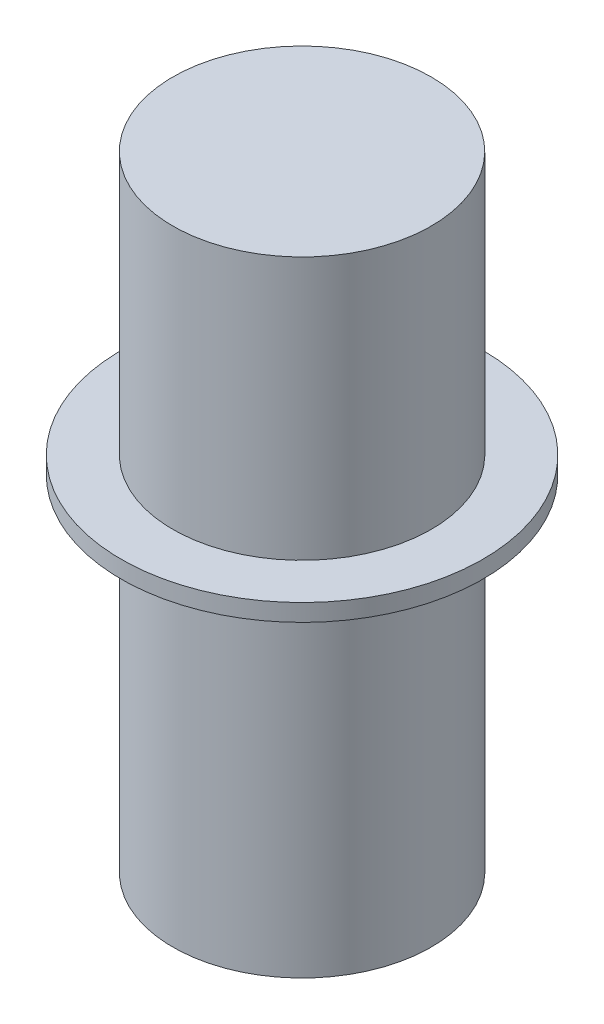
ISO-10303-21;
HEADER;
FILE_DESCRIPTION(('STEP AP214'),'2;1');
FILE_NAME('part.step','',(''),(''),'','','');
FILE_SCHEMA(('AUTOMOTIVE_DESIGN { 1 0 10303 214 1 1 1 1 }'));
ENDSEC;
DATA;
#1=APPLICATION_CONTEXT('core data for automotive mechanical design processes');
#2=APPLICATION_PROTOCOL_DEFINITION('international standard','automotive_design',2000,#1);
#3=PRODUCT_CONTEXT('',#1,'mechanical');
#4=PRODUCT('Part','Part','',(#3));
#5=PRODUCT_RELATED_PRODUCT_CATEGORY('part','',(#4));
#6=PRODUCT_DEFINITION_FORMATION('','',#4);
#7=PRODUCT_DEFINITION_CONTEXT('part definition',#1,'design');
#8=PRODUCT_DEFINITION('design','',#6,#7);
#9=PRODUCT_DEFINITION_SHAPE('','',#8);
#10=(LENGTH_UNIT() NAMED_UNIT(*) SI_UNIT(.MILLI.,.METRE.));
#11=(NAMED_UNIT(*) PLANE_ANGLE_UNIT() SI_UNIT($,.RADIAN.));
#12=(NAMED_UNIT(*) SI_UNIT($,.STERADIAN.) SOLID_ANGLE_UNIT());
#13=UNCERTAINTY_MEASURE_WITH_UNIT(LENGTH_MEASURE(1.E-05),#10,'distance_accuracy_value','');
#14=(GEOMETRIC_REPRESENTATION_CONTEXT(3) GLOBAL_UNCERTAINTY_ASSIGNED_CONTEXT((#13)) GLOBAL_UNIT_ASSIGNED_CONTEXT((#10,
#11,#12)) REPRESENTATION_CONTEXT('',''));
#15=CARTESIAN_POINT('',(0.,0.,0.));
#16=DIRECTION('',(0.,0.,1.));
#17=DIRECTION('',(1.,0.,0.));
#18=AXIS2_PLACEMENT_3D('',#15,#16,#17);
#19=CARTESIAN_POINT('',(0.,0.,0.));
#20=DIRECTION('',(0.,1.,0.));
#21=DIRECTION('',(0.,0.,1.));
#22=AXIS2_PLACEMENT_3D('',#19,#20,#21);
#23=PLANE('',#22);
#24=CARTESIAN_POINT('',(0.,0.,0.));
#25=DIRECTION('',(0.,-1.,0.));
#26=DIRECTION('',(0.,0.,-1.));
#27=AXIS2_PLACEMENT_3D('',#24,#25,#26);
#28=CIRCLE('',#27,15.);
#29=CARTESIAN_POINT('',(0.,0.,-15.));
#30=VERTEX_POINT('',#29);
#31=EDGE_CURVE('E10',#30,#30,#28,.T.);
#32=ORIENTED_EDGE('',*,*,#31,.T.);
#33=EDGE_LOOP('',(#32));
#34=FACE_BOUND('',#33,.T.);
#35=ADVANCED_FACE('F33',(#34),#23,.F.);
#36=CARTESIAN_POINT('',(0.,-22.4951294697904,0.));
#37=DIRECTION('',(0.,-1.,0.));
#38=DIRECTION('',(0.,0.,-1.));
#39=AXIS2_PLACEMENT_3D('',#36,#37,#38);
#40=CYLINDRICAL_SURFACE('',#39,15.);
#41=ORIENTED_EDGE('',*,*,#31,.F.);
#42=EDGE_LOOP('',(#41));
#43=FACE_BOUND('',#42,.T.);
#44=CARTESIAN_POINT('',(0.,40.,0.));
#45=DIRECTION('',(0.,-1.,0.));
#46=DIRECTION('',(0.,0.,-1.));
#47=AXIS2_PLACEMENT_3D('',#44,#45,#46);
#48=CIRCLE('',#47,15.);
#49=CARTESIAN_POINT('',(0.,40.,-15.));
#50=VERTEX_POINT('',#49);
#51=EDGE_CURVE('E39',#50,#50,#48,.T.);
#52=ORIENTED_EDGE('',*,*,#51,.T.);
#53=EDGE_LOOP('',(#52));
#54=FACE_BOUND('',#53,.T.);
#55=ADVANCED_FACE('F71',(#43,#54),#40,.T.);
#56=CARTESIAN_POINT('',(-15.,40.,0.));
#57=DIRECTION('',(0.,1.,0.));
#58=DIRECTION('',(0.,0.,1.));
#59=AXIS2_PLACEMENT_3D('',#56,#57,#58);
#60=PLANE('',#59);
#61=ORIENTED_EDGE('',*,*,#51,.F.);
#62=EDGE_LOOP('',(#61));
#63=FACE_BOUND('',#62,.T.);
#64=CARTESIAN_POINT('',(0.,40.,0.));
#65=DIRECTION('',(0.,-1.,0.));
#66=DIRECTION('',(0.,0.,-1.));
#67=AXIS2_PLACEMENT_3D('',#64,#65,#66);
#68=CIRCLE('',#67,21.);
#69=CARTESIAN_POINT('',(0.,40.,-21.));
#70=VERTEX_POINT('',#69);
#71=EDGE_CURVE('E43',#70,#70,#68,.T.);
#72=ORIENTED_EDGE('',*,*,#71,.T.);
#73=EDGE_LOOP('',(#72));
#74=FACE_BOUND('',#73,.T.);
#75=ADVANCED_FACE('F75',(#63,#74),#60,.F.);
#76=CARTESIAN_POINT('',(0.,-22.4951294697904,0.));
#77=DIRECTION('',(0.,-1.,0.));
#78=DIRECTION('',(0.,0.,-1.));
#79=AXIS2_PLACEMENT_3D('',#76,#77,#78);
#80=CYLINDRICAL_SURFACE('',#79,21.);
#81=ORIENTED_EDGE('',*,*,#71,.F.);
#82=EDGE_LOOP('',(#81));
#83=FACE_BOUND('',#82,.T.);
#84=CARTESIAN_POINT('',(0.,42.,0.));
#85=DIRECTION('',(0.,-1.,0.));
#86=DIRECTION('',(0.,0.,-1.));
#87=AXIS2_PLACEMENT_3D('',#84,#85,#86);
#88=CIRCLE('',#87,21.);
#89=CARTESIAN_POINT('',(0.,42.,-21.));
#90=VERTEX_POINT('',#89);
#91=EDGE_CURVE('E47',#90,#90,#88,.T.);
#92=ORIENTED_EDGE('',*,*,#91,.T.);
#93=EDGE_LOOP('',(#92));
#94=FACE_BOUND('',#93,.T.);
#95=ADVANCED_FACE('F80',(#83,#94),#80,.T.);
#96=CARTESIAN_POINT('',(-21.,42.,0.));
#97=DIRECTION('',(0.,-1.,0.));
#98=DIRECTION('',(0.,0.,-1.));
#99=AXIS2_PLACEMENT_3D('',#96,#97,#98);
#100=PLANE('',#99);
#101=ORIENTED_EDGE('',*,*,#91,.F.);
#102=EDGE_LOOP('',(#101));
#103=FACE_BOUND('',#102,.T.);
#104=CARTESIAN_POINT('',(0.,42.,0.));
#105=DIRECTION('',(0.,-1.,0.));
#106=DIRECTION('',(0.,0.,-1.));
#107=AXIS2_PLACEMENT_3D('',#104,#105,#106);
#108=CIRCLE('',#107,15.);
#109=CARTESIAN_POINT('',(0.,42.,-15.));
#110=VERTEX_POINT('',#109);
#111=EDGE_CURVE('E52',#110,#110,#108,.T.);
#112=ORIENTED_EDGE('',*,*,#111,.T.);
#113=EDGE_LOOP('',(#112));
#114=FACE_BOUND('',#113,.T.);
#115=ADVANCED_FACE('F67',(#103,#114),#100,.F.);
#116=CARTESIAN_POINT('',(0.,-22.4951294697904,0.));
#117=DIRECTION('',(0.,-1.,0.));
#118=DIRECTION('',(0.,0.,-1.));
#119=AXIS2_PLACEMENT_3D('',#116,#117,#118);
#120=CYLINDRICAL_SURFACE('',#119,15.);
#121=ORIENTED_EDGE('',*,*,#111,.F.);
#122=EDGE_LOOP('',(#121));
#123=FACE_BOUND('',#122,.T.);
#124=CARTESIAN_POINT('',(0.,72.5,0.));
#125=DIRECTION('',(0.,-1.,0.));
#126=DIRECTION('',(0.,0.,-1.));
#127=AXIS2_PLACEMENT_3D('',#124,#125,#126);
#128=CIRCLE('',#127,15.);
#129=CARTESIAN_POINT('',(0.,72.5,-15.));
#130=VERTEX_POINT('',#129);
#131=EDGE_CURVE('E55',#130,#130,#128,.T.);
#132=ORIENTED_EDGE('',*,*,#131,.T.);
#133=EDGE_LOOP('',(#132));
#134=FACE_BOUND('',#133,.T.);
#135=ADVANCED_FACE('F59',(#123,#134),#120,.T.);
#136=CARTESIAN_POINT('',(-15.,72.5,0.));
#137=DIRECTION('',(0.,-1.,0.));
#138=DIRECTION('',(0.,0.,-1.));
#139=AXIS2_PLACEMENT_3D('',#136,#137,#138);
#140=PLANE('',#139);
#141=ORIENTED_EDGE('',*,*,#131,.F.);
#142=EDGE_LOOP('',(#141));
#143=FACE_BOUND('',#142,.T.);
#144=ADVANCED_FACE('F61',(#143),#140,.F.);
#145=CLOSED_SHELL('',(#35,#55,#75,#95,#115,#135,#144));
#146=MANIFOLD_SOLID_BREP('B2',#145);
#147=ADVANCED_BREP_SHAPE_REPRESENTATION('',(#18,#146),#14);
#148=SHAPE_DEFINITION_REPRESENTATION(#9,#147);
ENDSEC;
END-ISO-10303-21;
